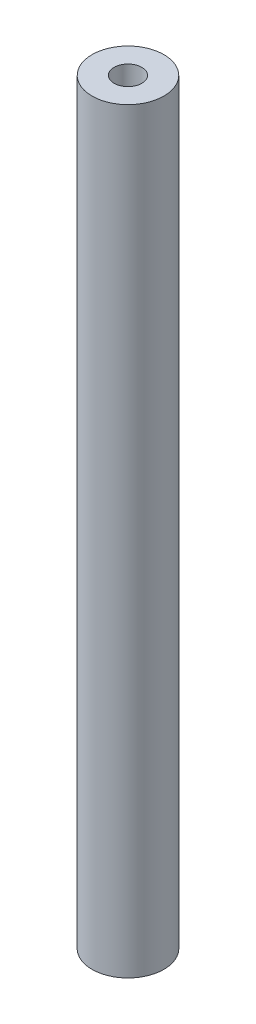
ISO-10303-21;
HEADER;
FILE_DESCRIPTION(('STEP AP214'),'2;1');
FILE_NAME('part.step','',(''),(''),'','','');
FILE_SCHEMA(('AUTOMOTIVE_DESIGN { 1 0 10303 214 1 1 1 1 }'));
ENDSEC;
DATA;
#1=APPLICATION_CONTEXT('core data for automotive mechanical design processes');
#2=APPLICATION_PROTOCOL_DEFINITION('international standard','automotive_design',2000,#1);
#3=PRODUCT_CONTEXT('',#1,'mechanical');
#4=PRODUCT('Part','Part','',(#3));
#5=PRODUCT_RELATED_PRODUCT_CATEGORY('part','',(#4));
#6=PRODUCT_DEFINITION_FORMATION('','',#4);
#7=PRODUCT_DEFINITION_CONTEXT('part definition',#1,'design');
#8=PRODUCT_DEFINITION('design','',#6,#7);
#9=PRODUCT_DEFINITION_SHAPE('','',#8);
#10=(LENGTH_UNIT() NAMED_UNIT(*) SI_UNIT(.MILLI.,.METRE.));
#11=(NAMED_UNIT(*) PLANE_ANGLE_UNIT() SI_UNIT($,.RADIAN.));
#12=(NAMED_UNIT(*) SI_UNIT($,.STERADIAN.) SOLID_ANGLE_UNIT());
#13=UNCERTAINTY_MEASURE_WITH_UNIT(LENGTH_MEASURE(1.E-05),#10,'distance_accuracy_value','');
#14=(GEOMETRIC_REPRESENTATION_CONTEXT(3) GLOBAL_UNCERTAINTY_ASSIGNED_CONTEXT((#13)) GLOBAL_UNIT_ASSIGNED_CONTEXT((#10,
#11,#12)) REPRESENTATION_CONTEXT('',''));
#15=CARTESIAN_POINT('',(0.,0.,0.));
#16=DIRECTION('',(0.,0.,1.));
#17=DIRECTION('',(1.,0.,0.));
#18=AXIS2_PLACEMENT_3D('',#15,#16,#17);
#19=CARTESIAN_POINT('',(0.,76.2,0.));
#20=DIRECTION('',(0.,1.,0.));
#21=DIRECTION('',(0.,0.,1.));
#22=AXIS2_PLACEMENT_3D('',#19,#20,#21);
#23=PLANE('',#22);
#24=CARTESIAN_POINT('',(0.,76.2,0.));
#25=DIRECTION('',(0.,1.,0.));
#26=DIRECTION('',(0.,0.,1.));
#27=AXIS2_PLACEMENT_3D('',#24,#25,#26);
#28=CIRCLE('',#27,3.6195);
#29=CARTESIAN_POINT('',(0.,76.2,3.6195));
#30=VERTEX_POINT('',#29);
#31=EDGE_CURVE('E10',#30,#30,#28,.T.);
#32=ORIENTED_EDGE('',*,*,#31,.T.);
#33=EDGE_LOOP('',(#32));
#34=FACE_BOUND('',#33,.T.);
#35=CARTESIAN_POINT('',(0.,76.2,0.));
#36=DIRECTION('',(0.,1.,0.));
#37=DIRECTION('',(0.,0.,1.));
#38=AXIS2_PLACEMENT_3D('',#35,#36,#37);
#39=CIRCLE('',#38,1.397);
#40=CARTESIAN_POINT('',(0.,76.2,1.397));
#41=VERTEX_POINT('',#40);
#42=EDGE_CURVE('E42',#41,#41,#39,.T.);
#43=ORIENTED_EDGE('',*,*,#42,.F.);
#44=EDGE_LOOP('',(#43));
#45=FACE_BOUND('',#44,.T.);
#46=ADVANCED_FACE('F31',(#34,#45),#23,.T.);
#47=CARTESIAN_POINT('',(0.,0.,0.));
#48=DIRECTION('',(0.,1.,0.));
#49=DIRECTION('',(0.,0.,1.));
#50=AXIS2_PLACEMENT_3D('',#47,#48,#49);
#51=PLANE('',#50);
#52=CARTESIAN_POINT('',(0.,0.,0.));
#53=DIRECTION('',(0.,1.,0.));
#54=DIRECTION('',(0.,0.,1.));
#55=AXIS2_PLACEMENT_3D('',#52,#53,#54);
#56=CIRCLE('',#55,3.6195);
#57=CARTESIAN_POINT('',(0.,0.,3.6195));
#58=VERTEX_POINT('',#57);
#59=EDGE_CURVE('E35',#58,#58,#56,.T.);
#60=ORIENTED_EDGE('',*,*,#59,.F.);
#61=EDGE_LOOP('',(#60));
#62=FACE_BOUND('',#61,.T.);
#63=CARTESIAN_POINT('',(0.,0.,0.));
#64=DIRECTION('',(0.,1.,0.));
#65=DIRECTION('',(0.,0.,1.));
#66=AXIS2_PLACEMENT_3D('',#63,#64,#65);
#67=CIRCLE('',#66,1.397);
#68=CARTESIAN_POINT('',(0.,0.,1.397));
#69=VERTEX_POINT('',#68);
#70=EDGE_CURVE('E44',#69,#69,#67,.T.);
#71=ORIENTED_EDGE('',*,*,#70,.T.);
#72=EDGE_LOOP('',(#71));
#73=FACE_BOUND('',#72,.T.);
#74=ADVANCED_FACE('F54',(#62,#73),#51,.F.);
#75=CARTESIAN_POINT('',(0.,76.2,0.));
#76=DIRECTION('',(0.,-1.,0.));
#77=DIRECTION('',(0.,0.,-1.));
#78=AXIS2_PLACEMENT_3D('',#75,#76,#77);
#79=CYLINDRICAL_SURFACE('',#78,3.6195);
#80=ORIENTED_EDGE('',*,*,#31,.F.);
#81=EDGE_LOOP('',(#80));
#82=FACE_BOUND('',#81,.T.);
#83=ORIENTED_EDGE('',*,*,#59,.T.);
#84=EDGE_LOOP('',(#83));
#85=FACE_BOUND('',#84,.T.);
#86=ADVANCED_FACE('F33',(#82,#85),#79,.T.);
#87=CARTESIAN_POINT('',(0.,76.2,0.));
#88=DIRECTION('',(0.,-1.,0.));
#89=DIRECTION('',(0.,0.,-1.));
#90=AXIS2_PLACEMENT_3D('',#87,#88,#89);
#91=CYLINDRICAL_SURFACE('',#90,1.397);
#92=ORIENTED_EDGE('',*,*,#42,.T.);
#93=EDGE_LOOP('',(#92));
#94=FACE_BOUND('',#93,.T.);
#95=ORIENTED_EDGE('',*,*,#70,.F.);
#96=EDGE_LOOP('',(#95));
#97=FACE_BOUND('',#96,.T.);
#98=ADVANCED_FACE('F50',(#94,#97),#91,.F.);
#99=CLOSED_SHELL('',(#46,#74,#86,#98));
#100=MANIFOLD_SOLID_BREP('B2',#99);
#101=ADVANCED_BREP_SHAPE_REPRESENTATION('',(#18,#100),#14);
#102=SHAPE_DEFINITION_REPRESENTATION(#9,#101);
ENDSEC;
END-ISO-10303-21;
